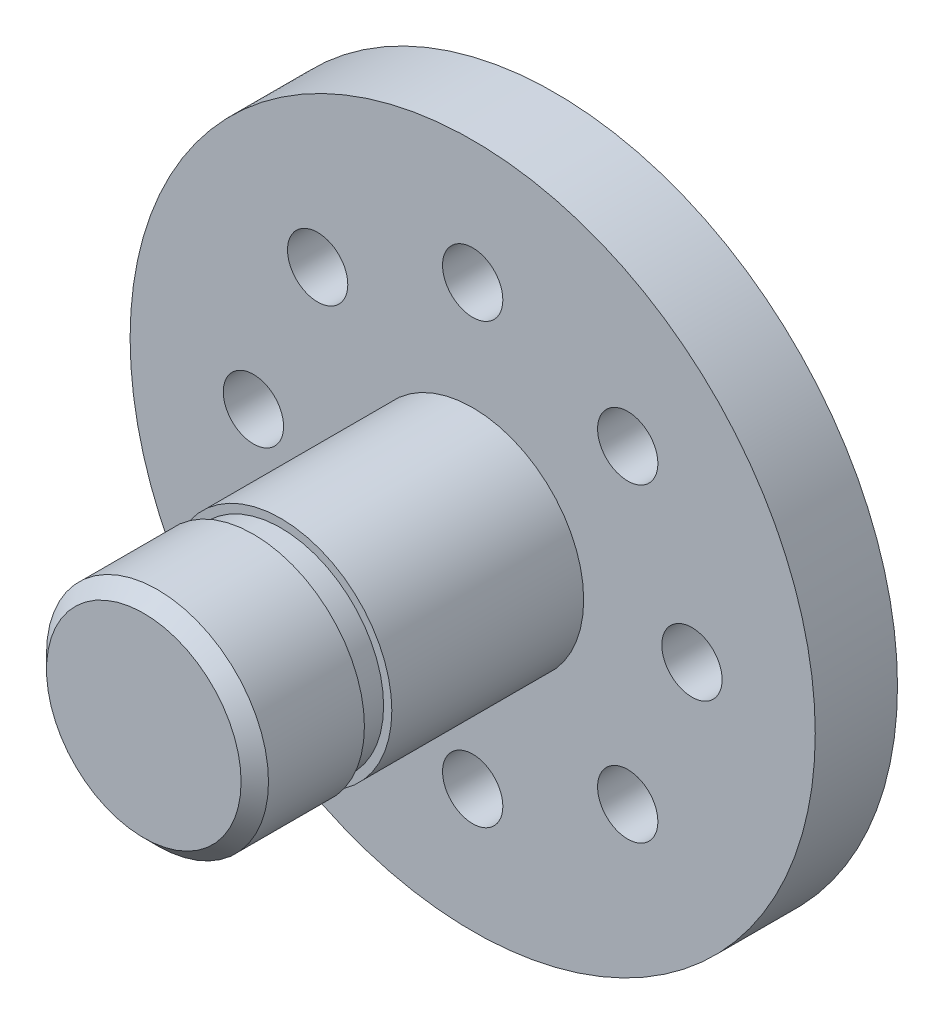
ISO-10303-21;
HEADER;
FILE_DESCRIPTION(('STEP AP214'),'2;1');
FILE_NAME('part.step','',(''),(''),'','','');
FILE_SCHEMA(('AUTOMOTIVE_DESIGN { 1 0 10303 214 1 1 1 1 }'));
ENDSEC;
DATA;
#1=APPLICATION_CONTEXT('core data for automotive mechanical design processes');
#2=APPLICATION_PROTOCOL_DEFINITION('international standard','automotive_design',2000,#1);
#3=PRODUCT_CONTEXT('',#1,'mechanical');
#4=PRODUCT('Part','Part','',(#3));
#5=PRODUCT_RELATED_PRODUCT_CATEGORY('part','',(#4));
#6=PRODUCT_DEFINITION_FORMATION('','',#4);
#7=PRODUCT_DEFINITION_CONTEXT('part definition',#1,'design');
#8=PRODUCT_DEFINITION('design','',#6,#7);
#9=PRODUCT_DEFINITION_SHAPE('','',#8);
#10=(LENGTH_UNIT() NAMED_UNIT(*) SI_UNIT(.MILLI.,.METRE.));
#11=(NAMED_UNIT(*) PLANE_ANGLE_UNIT() SI_UNIT($,.RADIAN.));
#12=(NAMED_UNIT(*) SI_UNIT($,.STERADIAN.) SOLID_ANGLE_UNIT());
#13=UNCERTAINTY_MEASURE_WITH_UNIT(LENGTH_MEASURE(1.E-05),#10,'distance_accuracy_value','');
#14=(GEOMETRIC_REPRESENTATION_CONTEXT(3) GLOBAL_UNCERTAINTY_ASSIGNED_CONTEXT((#13)) GLOBAL_UNIT_ASSIGNED_CONTEXT((#10,
#11,#12)) REPRESENTATION_CONTEXT('',''));
#15=CARTESIAN_POINT('',(0.,0.,0.));
#16=DIRECTION('',(0.,0.,1.));
#17=DIRECTION('',(1.,0.,0.));
#18=AXIS2_PLACEMENT_3D('',#15,#16,#17);
#19=CARTESIAN_POINT('',(0.,0.,15.));
#20=DIRECTION('',(0.,0.,-1.));
#21=DIRECTION('',(-1.,0.,0.));
#22=AXIS2_PLACEMENT_3D('',#19,#20,#21);
#23=CYLINDRICAL_SURFACE('',#22,4.05);
#24=CARTESIAN_POINT('',(0.,0.,3.));
#25=DIRECTION('',(0.,0.,1.));
#26=DIRECTION('',(1.,0.,0.));
#27=AXIS2_PLACEMENT_3D('',#24,#25,#26);
#28=CIRCLE('',#27,4.05);
#29=CARTESIAN_POINT('',(4.05,0.,3.));
#30=VERTEX_POINT('',#29);
#31=EDGE_CURVE('E60',#30,#30,#28,.T.);
#32=ORIENTED_EDGE('',*,*,#31,.T.);
#33=EDGE_LOOP('',(#32));
#34=FACE_BOUND('',#33,.T.);
#35=CARTESIAN_POINT('',(0.,0.,10.));
#36=DIRECTION('',(0.,0.,1.));
#37=DIRECTION('',(1.,0.,0.));
#38=AXIS2_PLACEMENT_3D('',#35,#36,#37);
#39=CIRCLE('',#38,4.05);
#40=CARTESIAN_POINT('',(4.05,0.,10.));
#41=VERTEX_POINT('',#40);
#42=EDGE_CURVE('E61',#41,#41,#39,.T.);
#43=ORIENTED_EDGE('',*,*,#42,.F.);
#44=EDGE_LOOP('',(#43));
#45=FACE_BOUND('',#44,.T.);
#46=ADVANCED_FACE('F38',(#34,#45),#23,.T.);
#47=CARTESIAN_POINT('',(0.,0.,3.));
#48=DIRECTION('',(0.,0.,1.));
#49=DIRECTION('',(1.,0.,0.));
#50=AXIS2_PLACEMENT_3D('',#47,#48,#49);
#51=PLANE('',#50);
#52=ORIENTED_EDGE('',*,*,#31,.F.);
#53=EDGE_LOOP('',(#52));
#54=FACE_BOUND('',#53,.T.);
#55=CARTESIAN_POINT('',(-7.99999999999956,-4.46539741409631E-13,3.));
#56=DIRECTION('',(0.,0.,1.));
#57=DIRECTION('',(1.,0.,0.));
#58=AXIS2_PLACEMENT_3D('',#55,#56,#57);
#59=CIRCLE('',#58,1.10000000000066);
#60=CARTESIAN_POINT('',(-6.89999999999889,-4.46539741409631E-13,3.));
#61=VERTEX_POINT('',#60);
#62=EDGE_CURVE('E101',#61,#61,#59,.T.);
#63=ORIENTED_EDGE('',*,*,#62,.F.);
#64=EDGE_LOOP('',(#63));
#65=FACE_BOUND('',#64,.T.);
#66=CARTESIAN_POINT('',(8.91120047940625E-13,-8.,3.));
#67=DIRECTION('',(0.,0.,1.));
#68=DIRECTION('',(1.,0.,0.));
#69=AXIS2_PLACEMENT_3D('',#66,#67,#68);
#70=CIRCLE('',#69,1.10000000000066);
#71=CARTESIAN_POINT('',(1.10000000000155,-8.,3.));
#72=VERTEX_POINT('',#71);
#73=EDGE_CURVE('E89',#72,#72,#70,.T.);
#74=ORIENTED_EDGE('',*,*,#73,.F.);
#75=EDGE_LOOP('',(#74));
#76=FACE_BOUND('',#75,.T.);
#77=CARTESIAN_POINT('',(8.00000000000044,4.45560023970313E-13,3.));
#78=DIRECTION('',(0.,0.,1.));
#79=DIRECTION('',(1.,0.,0.));
#80=AXIS2_PLACEMENT_3D('',#77,#78,#79);
#81=CIRCLE('',#80,1.10000000000066);
#82=CARTESIAN_POINT('',(9.10000000000111,4.45560023970313E-13,3.));
#83=VERTEX_POINT('',#82);
#84=EDGE_CURVE('E77',#83,#83,#81,.T.);
#85=ORIENTED_EDGE('',*,*,#84,.F.);
#86=EDGE_LOOP('',(#85));
#87=FACE_BOUND('',#86,.T.);
#88=CARTESIAN_POINT('',(0.,8.,3.));
#89=DIRECTION('',(0.,0.,1.));
#90=DIRECTION('',(1.,0.,0.));
#91=AXIS2_PLACEMENT_3D('',#88,#89,#90);
#92=CIRCLE('',#91,1.10000000000066);
#93=CARTESIAN_POINT('',(1.10000000000066,8.,3.));
#94=VERTEX_POINT('',#93);
#95=EDGE_CURVE('E66',#94,#94,#92,.T.);
#96=ORIENTED_EDGE('',*,*,#95,.F.);
#97=EDGE_LOOP('',(#96));
#98=FACE_BOUND('',#97,.T.);
#99=CARTESIAN_POINT('',(0.,0.,3.));
#100=DIRECTION('',(0.,0.,1.));
#101=DIRECTION('',(1.,0.,0.));
#102=AXIS2_PLACEMENT_3D('',#99,#100,#101);
#103=CIRCLE('',#102,12.5);
#104=CARTESIAN_POINT('',(12.5,0.,3.));
#105=VERTEX_POINT('',#104);
#106=EDGE_CURVE('E50',#105,#105,#103,.T.);
#107=ORIENTED_EDGE('',*,*,#106,.T.);
#108=EDGE_LOOP('',(#107));
#109=FACE_BOUND('',#108,.T.);
#110=CARTESIAN_POINT('',(5.65685424949251,5.65685424949269,3.));
#111=DIRECTION('',(0.,0.,1.));
#112=DIRECTION('',(1.,0.,0.));
#113=AXIS2_PLACEMENT_3D('',#110,#111,#112);
#114=CIRCLE('',#113,1.10000000000066);
#115=CARTESIAN_POINT('',(6.75685424949317,5.65685424949269,3.));
#116=VERTEX_POINT('',#115);
#117=EDGE_CURVE('E71',#116,#116,#114,.T.);
#118=ORIENTED_EDGE('',*,*,#117,.F.);
#119=EDGE_LOOP('',(#118));
#120=FACE_BOUND('',#119,.T.);
#121=CARTESIAN_POINT('',(5.65685424949314,-5.65685424949207,3.));
#122=DIRECTION('',(0.,0.,1.));
#123=DIRECTION('',(1.,0.,0.));
#124=AXIS2_PLACEMENT_3D('',#121,#122,#123);
#125=CIRCLE('',#124,1.10000000000069);
#126=CARTESIAN_POINT('',(6.75685424949383,-5.65685424949207,3.));
#127=VERTEX_POINT('',#126);
#128=EDGE_CURVE('E83',#127,#127,#125,.T.);
#129=ORIENTED_EDGE('',*,*,#128,.F.);
#130=EDGE_LOOP('',(#129));
#131=FACE_BOUND('',#130,.T.);
#132=CARTESIAN_POINT('',(-5.65685424949162,-5.6568542494927,3.));
#133=DIRECTION('',(0.,0.,1.));
#134=DIRECTION('',(1.,0.,0.));
#135=AXIS2_PLACEMENT_3D('',#132,#133,#134);
#136=CIRCLE('',#135,1.10000000000066);
#137=CARTESIAN_POINT('',(-4.55685424949096,-5.6568542494927,3.));
#138=VERTEX_POINT('',#137);
#139=EDGE_CURVE('E95',#138,#138,#136,.T.);
#140=ORIENTED_EDGE('',*,*,#139,.F.);
#141=EDGE_LOOP('',(#140));
#142=FACE_BOUND('',#141,.T.);
#143=CARTESIAN_POINT('',(-5.65685424949225,5.65685424949206,3.));
#144=DIRECTION('',(0.,0.,1.));
#145=DIRECTION('',(1.,0.,0.));
#146=AXIS2_PLACEMENT_3D('',#143,#144,#145);
#147=CIRCLE('',#146,1.10000000000066);
#148=CARTESIAN_POINT('',(-4.55685424949159,5.65685424949206,3.));
#149=VERTEX_POINT('',#148);
#150=EDGE_CURVE('E107',#149,#149,#147,.T.);
#151=ORIENTED_EDGE('',*,*,#150,.F.);
#152=EDGE_LOOP('',(#151));
#153=FACE_BOUND('',#152,.T.);
#154=ADVANCED_FACE('F134',(#54,#65,#76,#87,#98,#109,#120,#131,#142,#153),#51,.T.);
#155=CARTESIAN_POINT('',(0.,0.,0.));
#156=DIRECTION('',(0.,0.,1.));
#157=DIRECTION('',(1.,0.,0.));
#158=AXIS2_PLACEMENT_3D('',#155,#156,#157);
#159=PLANE('',#158);
#160=CARTESIAN_POINT('',(0.,0.,0.));
#161=DIRECTION('',(0.,0.,1.));
#162=DIRECTION('',(1.,0.,0.));
#163=AXIS2_PLACEMENT_3D('',#160,#161,#162);
#164=CIRCLE('',#163,12.5);
#165=CARTESIAN_POINT('',(12.5,0.,0.));
#166=VERTEX_POINT('',#165);
#167=EDGE_CURVE('E54',#166,#166,#164,.T.);
#168=ORIENTED_EDGE('',*,*,#167,.F.);
#169=EDGE_LOOP('',(#168));
#170=FACE_BOUND('',#169,.T.);
#171=CARTESIAN_POINT('',(0.,8.,0.));
#172=DIRECTION('',(0.,0.,1.));
#173=DIRECTION('',(1.,0.,0.));
#174=AXIS2_PLACEMENT_3D('',#171,#172,#173);
#175=CIRCLE('',#174,1.10000000000066);
#176=CARTESIAN_POINT('',(1.10000000000066,8.,0.));
#177=VERTEX_POINT('',#176);
#178=EDGE_CURVE('E68',#177,#177,#175,.T.);
#179=ORIENTED_EDGE('',*,*,#178,.T.);
#180=EDGE_LOOP('',(#179));
#181=FACE_BOUND('',#180,.T.);
#182=CARTESIAN_POINT('',(5.65685424949251,5.65685424949269,0.));
#183=DIRECTION('',(0.,0.,1.));
#184=DIRECTION('',(1.,0.,0.));
#185=AXIS2_PLACEMENT_3D('',#182,#183,#184);
#186=CIRCLE('',#185,1.10000000000066);
#187=CARTESIAN_POINT('',(6.75685424949317,5.65685424949269,0.));
#188=VERTEX_POINT('',#187);
#189=EDGE_CURVE('E74',#188,#188,#186,.T.);
#190=ORIENTED_EDGE('',*,*,#189,.T.);
#191=EDGE_LOOP('',(#190));
#192=FACE_BOUND('',#191,.T.);
#193=CARTESIAN_POINT('',(8.00000000000044,4.45560023970313E-13,0.));
#194=DIRECTION('',(0.,0.,1.));
#195=DIRECTION('',(1.,0.,0.));
#196=AXIS2_PLACEMENT_3D('',#193,#194,#195);
#197=CIRCLE('',#196,1.10000000000066);
#198=CARTESIAN_POINT('',(9.10000000000111,4.45560023970313E-13,0.));
#199=VERTEX_POINT('',#198);
#200=EDGE_CURVE('E80',#199,#199,#197,.T.);
#201=ORIENTED_EDGE('',*,*,#200,.T.);
#202=EDGE_LOOP('',(#201));
#203=FACE_BOUND('',#202,.T.);
#204=CARTESIAN_POINT('',(5.65685424949314,-5.65685424949207,0.));
#205=DIRECTION('',(0.,0.,1.));
#206=DIRECTION('',(1.,0.,0.));
#207=AXIS2_PLACEMENT_3D('',#204,#205,#206);
#208=CIRCLE('',#207,1.10000000000069);
#209=CARTESIAN_POINT('',(6.75685424949383,-5.65685424949207,0.));
#210=VERTEX_POINT('',#209);
#211=EDGE_CURVE('E86',#210,#210,#208,.T.);
#212=ORIENTED_EDGE('',*,*,#211,.T.);
#213=EDGE_LOOP('',(#212));
#214=FACE_BOUND('',#213,.T.);
#215=CARTESIAN_POINT('',(8.91120047940625E-13,-8.,0.));
#216=DIRECTION('',(0.,0.,1.));
#217=DIRECTION('',(1.,0.,0.));
#218=AXIS2_PLACEMENT_3D('',#215,#216,#217);
#219=CIRCLE('',#218,1.10000000000066);
#220=CARTESIAN_POINT('',(1.10000000000155,-8.,0.));
#221=VERTEX_POINT('',#220);
#222=EDGE_CURVE('E92',#221,#221,#219,.T.);
#223=ORIENTED_EDGE('',*,*,#222,.T.);
#224=EDGE_LOOP('',(#223));
#225=FACE_BOUND('',#224,.T.);
#226=CARTESIAN_POINT('',(-5.65685424949162,-5.6568542494927,0.));
#227=DIRECTION('',(0.,0.,1.));
#228=DIRECTION('',(1.,0.,0.));
#229=AXIS2_PLACEMENT_3D('',#226,#227,#228);
#230=CIRCLE('',#229,1.10000000000066);
#231=CARTESIAN_POINT('',(-4.55685424949096,-5.6568542494927,0.));
#232=VERTEX_POINT('',#231);
#233=EDGE_CURVE('E98',#232,#232,#230,.T.);
#234=ORIENTED_EDGE('',*,*,#233,.T.);
#235=EDGE_LOOP('',(#234));
#236=FACE_BOUND('',#235,.T.);
#237=CARTESIAN_POINT('',(-7.99999999999956,-4.46539741409631E-13,0.));
#238=DIRECTION('',(0.,0.,1.));
#239=DIRECTION('',(1.,0.,0.));
#240=AXIS2_PLACEMENT_3D('',#237,#238,#239);
#241=CIRCLE('',#240,1.10000000000066);
#242=CARTESIAN_POINT('',(-6.89999999999889,-4.46539741409631E-13,0.));
#243=VERTEX_POINT('',#242);
#244=EDGE_CURVE('E104',#243,#243,#241,.T.);
#245=ORIENTED_EDGE('',*,*,#244,.T.);
#246=EDGE_LOOP('',(#245));
#247=FACE_BOUND('',#246,.T.);
#248=CARTESIAN_POINT('',(-5.65685424949225,5.65685424949206,0.));
#249=DIRECTION('',(0.,0.,1.));
#250=DIRECTION('',(1.,0.,0.));
#251=AXIS2_PLACEMENT_3D('',#248,#249,#250);
#252=CIRCLE('',#251,1.10000000000066);
#253=CARTESIAN_POINT('',(-4.55685424949159,5.65685424949206,0.));
#254=VERTEX_POINT('',#253);
#255=EDGE_CURVE('E110',#254,#254,#252,.T.);
#256=ORIENTED_EDGE('',*,*,#255,.T.);
#257=EDGE_LOOP('',(#256));
#258=FACE_BOUND('',#257,.T.);
#259=ADVANCED_FACE('F141',(#170,#181,#192,#203,#214,#225,#236,#247,#258),#159,.F.);
#260=CARTESIAN_POINT('',(0.,0.,3.));
#261=DIRECTION('',(0.,0.,-1.));
#262=DIRECTION('',(-1.,0.,0.));
#263=AXIS2_PLACEMENT_3D('',#260,#261,#262);
#264=CYLINDRICAL_SURFACE('',#263,12.5);
#265=ORIENTED_EDGE('',*,*,#106,.F.);
#266=EDGE_LOOP('',(#265));
#267=FACE_BOUND('',#266,.T.);
#268=ORIENTED_EDGE('',*,*,#167,.T.);
#269=EDGE_LOOP('',(#268));
#270=FACE_BOUND('',#269,.T.);
#271=ADVANCED_FACE('F282',(#267,#270),#264,.T.);
#272=CARTESIAN_POINT('',(0.,8.,3.));
#273=DIRECTION('',(0.,0.,-1.));
#274=DIRECTION('',(-1.,0.,0.));
#275=AXIS2_PLACEMENT_3D('',#272,#273,#274);
#276=CYLINDRICAL_SURFACE('',#275,1.10000000000066);
#277=ORIENTED_EDGE('',*,*,#95,.T.);
#278=EDGE_LOOP('',(#277));
#279=FACE_BOUND('',#278,.T.);
#280=ORIENTED_EDGE('',*,*,#178,.F.);
#281=EDGE_LOOP('',(#280));
#282=FACE_BOUND('',#281,.T.);
#283=ADVANCED_FACE('F272',(#279,#282),#276,.F.);
#284=CARTESIAN_POINT('',(5.65685424949251,5.65685424949269,3.));
#285=DIRECTION('',(0.,0.,-1.));
#286=DIRECTION('',(-1.,0.,0.));
#287=AXIS2_PLACEMENT_3D('',#284,#285,#286);
#288=CYLINDRICAL_SURFACE('',#287,1.10000000000066);
#289=ORIENTED_EDGE('',*,*,#117,.T.);
#290=EDGE_LOOP('',(#289));
#291=FACE_BOUND('',#290,.T.);
#292=ORIENTED_EDGE('',*,*,#189,.F.);
#293=EDGE_LOOP('',(#292));
#294=FACE_BOUND('',#293,.T.);
#295=ADVANCED_FACE('F262',(#291,#294),#288,.F.);
#296=CARTESIAN_POINT('',(8.00000000000044,4.45560023970313E-13,3.));
#297=DIRECTION('',(0.,0.,-1.));
#298=DIRECTION('',(-1.,0.,0.));
#299=AXIS2_PLACEMENT_3D('',#296,#297,#298);
#300=CYLINDRICAL_SURFACE('',#299,1.10000000000066);
#301=ORIENTED_EDGE('',*,*,#84,.T.);
#302=EDGE_LOOP('',(#301));
#303=FACE_BOUND('',#302,.T.);
#304=ORIENTED_EDGE('',*,*,#200,.F.);
#305=EDGE_LOOP('',(#304));
#306=FACE_BOUND('',#305,.T.);
#307=ADVANCED_FACE('F252',(#303,#306),#300,.F.);
#308=CARTESIAN_POINT('',(5.65685424949314,-5.65685424949207,3.));
#309=DIRECTION('',(0.,0.,-1.));
#310=DIRECTION('',(-1.,0.,0.));
#311=AXIS2_PLACEMENT_3D('',#308,#309,#310);
#312=CYLINDRICAL_SURFACE('',#311,1.10000000000069);
#313=ORIENTED_EDGE('',*,*,#128,.T.);
#314=EDGE_LOOP('',(#313));
#315=FACE_BOUND('',#314,.T.);
#316=ORIENTED_EDGE('',*,*,#211,.F.);
#317=EDGE_LOOP('',(#316));
#318=FACE_BOUND('',#317,.T.);
#319=ADVANCED_FACE('F242',(#315,#318),#312,.F.);
#320=CARTESIAN_POINT('',(8.91120047940625E-13,-8.,3.));
#321=DIRECTION('',(0.,0.,-1.));
#322=DIRECTION('',(-1.,0.,0.));
#323=AXIS2_PLACEMENT_3D('',#320,#321,#322);
#324=CYLINDRICAL_SURFACE('',#323,1.10000000000066);
#325=ORIENTED_EDGE('',*,*,#73,.T.);
#326=EDGE_LOOP('',(#325));
#327=FACE_BOUND('',#326,.T.);
#328=ORIENTED_EDGE('',*,*,#222,.F.);
#329=EDGE_LOOP('',(#328));
#330=FACE_BOUND('',#329,.T.);
#331=ADVANCED_FACE('F232',(#327,#330),#324,.F.);
#332=CARTESIAN_POINT('',(-5.65685424949162,-5.6568542494927,3.));
#333=DIRECTION('',(0.,0.,-1.));
#334=DIRECTION('',(-1.,0.,0.));
#335=AXIS2_PLACEMENT_3D('',#332,#333,#334);
#336=CYLINDRICAL_SURFACE('',#335,1.10000000000066);
#337=ORIENTED_EDGE('',*,*,#139,.T.);
#338=EDGE_LOOP('',(#337));
#339=FACE_BOUND('',#338,.T.);
#340=ORIENTED_EDGE('',*,*,#233,.F.);
#341=EDGE_LOOP('',(#340));
#342=FACE_BOUND('',#341,.T.);
#343=ADVANCED_FACE('F222',(#339,#342),#336,.F.);
#344=CARTESIAN_POINT('',(-7.99999999999956,-4.46539741409631E-13,3.));
#345=DIRECTION('',(0.,0.,-1.));
#346=DIRECTION('',(-1.,0.,0.));
#347=AXIS2_PLACEMENT_3D('',#344,#345,#346);
#348=CYLINDRICAL_SURFACE('',#347,1.10000000000066);
#349=ORIENTED_EDGE('',*,*,#62,.T.);
#350=EDGE_LOOP('',(#349));
#351=FACE_BOUND('',#350,.T.);
#352=ORIENTED_EDGE('',*,*,#244,.F.);
#353=EDGE_LOOP('',(#352));
#354=FACE_BOUND('',#353,.T.);
#355=ADVANCED_FACE('F163',(#351,#354),#348,.F.);
#356=CARTESIAN_POINT('',(-5.65685424949225,5.65685424949206,3.));
#357=DIRECTION('',(0.,0.,-1.));
#358=DIRECTION('',(-1.,0.,0.));
#359=AXIS2_PLACEMENT_3D('',#356,#357,#358);
#360=CYLINDRICAL_SURFACE('',#359,1.10000000000066);
#361=ORIENTED_EDGE('',*,*,#150,.T.);
#362=EDGE_LOOP('',(#361));
#363=FACE_BOUND('',#362,.T.);
#364=ORIENTED_EDGE('',*,*,#255,.F.);
#365=EDGE_LOOP('',(#364));
#366=FACE_BOUND('',#365,.T.);
#367=ADVANCED_FACE('F157',(#363,#366),#360,.F.);
#368=CARTESIAN_POINT('',(0.,3.75,11.));
#369=DIRECTION('',(0.,0.,-1.));
#370=DIRECTION('',(-1.,0.,0.));
#371=AXIS2_PLACEMENT_3D('',#368,#369,#370);
#372=PLANE('',#371);
#373=CARTESIAN_POINT('',(0.,0.,11.));
#374=DIRECTION('',(0.,0.,1.));
#375=DIRECTION('',(1.,0.,0.));
#376=AXIS2_PLACEMENT_3D('',#373,#374,#375);
#377=CIRCLE('',#376,3.75);
#378=CARTESIAN_POINT('',(3.75,0.,11.));
#379=VERTEX_POINT('',#378);
#380=EDGE_CURVE('E64',#379,#379,#377,.T.);
#381=ORIENTED_EDGE('',*,*,#380,.T.);
#382=EDGE_LOOP('',(#381));
#383=FACE_BOUND('',#382,.T.);
#384=CARTESIAN_POINT('',(0.,0.,11.));
#385=DIRECTION('',(0.,0.,-1.));
#386=DIRECTION('',(-1.,0.,0.));
#387=AXIS2_PLACEMENT_3D('',#384,#385,#386);
#388=CIRCLE('',#387,4.05);
#389=CARTESIAN_POINT('',(-4.05,0.,11.));
#390=VERTEX_POINT('',#389);
#391=EDGE_CURVE('E57',#390,#390,#388,.T.);
#392=ORIENTED_EDGE('',*,*,#391,.T.);
#393=EDGE_LOOP('',(#392));
#394=FACE_BOUND('',#393,.T.);
#395=ADVANCED_FACE('F129',(#383,#394),#372,.T.);
#396=CARTESIAN_POINT('',(0.,3.75,10.));
#397=DIRECTION('',(0.,0.,1.));
#398=DIRECTION('',(1.,0.,0.));
#399=AXIS2_PLACEMENT_3D('',#396,#397,#398);
#400=PLANE('',#399);
#401=CARTESIAN_POINT('',(0.,0.,10.));
#402=DIRECTION('',(0.,0.,1.));
#403=DIRECTION('',(1.,0.,0.));
#404=AXIS2_PLACEMENT_3D('',#401,#402,#403);
#405=CIRCLE('',#404,3.75);
#406=CARTESIAN_POINT('',(3.75,0.,10.));
#407=VERTEX_POINT('',#406);
#408=EDGE_CURVE('E119',#407,#407,#405,.T.);
#409=ORIENTED_EDGE('',*,*,#408,.F.);
#410=EDGE_LOOP('',(#409));
#411=FACE_BOUND('',#410,.T.);
#412=ORIENTED_EDGE('',*,*,#42,.T.);
#413=EDGE_LOOP('',(#412));
#414=FACE_BOUND('',#413,.T.);
#415=ADVANCED_FACE('F126',(#411,#414),#400,.T.);
#416=CARTESIAN_POINT('',(0.,0.,15.));
#417=DIRECTION('',(0.,0.,1.));
#418=DIRECTION('',(1.,0.,0.));
#419=AXIS2_PLACEMENT_3D('',#416,#417,#418);
#420=CYLINDRICAL_SURFACE('',#419,3.75);
#421=ORIENTED_EDGE('',*,*,#408,.T.);
#422=EDGE_LOOP('',(#421));
#423=FACE_BOUND('',#422,.T.);
#424=ORIENTED_EDGE('',*,*,#380,.F.);
#425=EDGE_LOOP('',(#424));
#426=FACE_BOUND('',#425,.T.);
#427=ADVANCED_FACE('F123',(#423,#426),#420,.T.);
#428=CARTESIAN_POINT('',(0.,0.,15.));
#429=DIRECTION('',(0.,0.,1.));
#430=DIRECTION('',(1.,0.,0.));
#431=AXIS2_PLACEMENT_3D('',#428,#429,#430);
#432=PLANE('',#431);
#433=CARTESIAN_POINT('',(0.,0.,15.));
#434=DIRECTION('',(0.,0.,1.));
#435=DIRECTION('',(1.,0.,0.));
#436=AXIS2_PLACEMENT_3D('',#433,#434,#435);
#437=CIRCLE('',#436,3.55);
#438=CARTESIAN_POINT('',(3.55,0.,15.));
#439=VERTEX_POINT('',#438);
#440=EDGE_CURVE('E46',#439,#439,#437,.T.);
#441=ORIENTED_EDGE('',*,*,#440,.T.);
#442=EDGE_LOOP('',(#441));
#443=FACE_BOUND('',#442,.T.);
#444=ADVANCED_FACE('F147',(#443),#432,.T.);
#445=CARTESIAN_POINT('',(0.,0.,14.5));
#446=DIRECTION('',(0.,0.,1.));
#447=DIRECTION('',(1.,0.,0.));
#448=AXIS2_PLACEMENT_3D('',#445,#446,#447);
#449=CIRCLE('',#448,4.05);
#450=CARTESIAN_POINT('',(4.05,0.,14.5));
#451=VERTEX_POINT('',#450);
#452=EDGE_CURVE('E12',#451,#451,#449,.F.);
#453=ORIENTED_EDGE('',*,*,#452,.T.);
#454=EDGE_LOOP('',(#453));
#455=FACE_BOUND('',#454,.T.);
#456=ORIENTED_EDGE('',*,*,#391,.F.);
#457=EDGE_LOOP('',(#456));
#458=FACE_BOUND('',#457,.T.);
#459=ADVANCED_FACE('F137',(#455,#458),#23,.T.);
#460=CARTESIAN_POINT('',(0.,0.,15.));
#461=DIRECTION('',(0.,0.,-1.));
#462=DIRECTION('',(-1.,0.,0.));
#463=AXIS2_PLACEMENT_3D('',#460,#461,#462);
#464=CONICAL_SURFACE('',#463,3.55,0.785398163397448);
#465=ORIENTED_EDGE('',*,*,#452,.F.);
#466=EDGE_LOOP('',(#465));
#467=FACE_BOUND('',#466,.T.);
#468=ORIENTED_EDGE('',*,*,#440,.F.);
#469=EDGE_LOOP('',(#468));
#470=FACE_BOUND('',#469,.T.);
#471=ADVANCED_FACE('F41',(#467,#470),#464,.T.);
#472=CLOSED_SHELL('',(#46,#154,#259,#271,#283,#295,#307,#319,#331,#343,#355,#367,#395,#415,#427,
#444,#459,#471));
#473=MANIFOLD_SOLID_BREP('B2',#472);
#474=ADVANCED_BREP_SHAPE_REPRESENTATION('',(#18,#473),#14);
#475=SHAPE_DEFINITION_REPRESENTATION(#9,#474);
ENDSEC;
END-ISO-10303-21;
